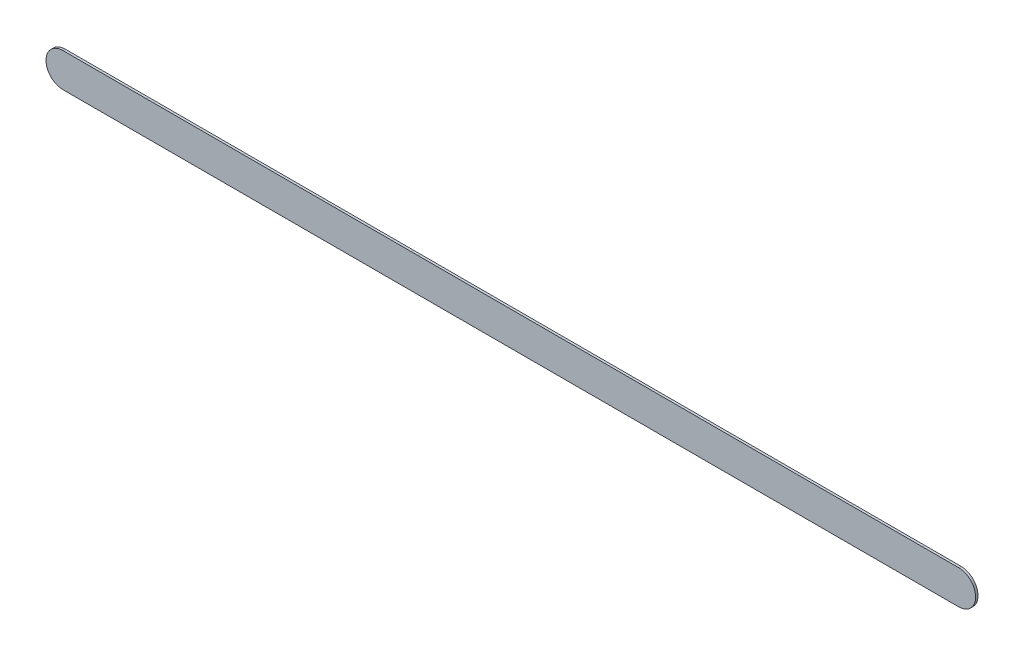
ISO-10303-21;
HEADER;
FILE_DESCRIPTION(('STEP AP214'),'2;1');
FILE_NAME('part.step','',(''),(''),'','','');
FILE_SCHEMA(('AUTOMOTIVE_DESIGN { 1 0 10303 214 1 1 1 1 }'));
ENDSEC;
DATA;
#1=APPLICATION_CONTEXT('core data for automotive mechanical design processes');
#2=APPLICATION_PROTOCOL_DEFINITION('international standard','automotive_design',2000,#1);
#3=PRODUCT_CONTEXT('',#1,'mechanical');
#4=PRODUCT('Part','Part','',(#3));
#5=PRODUCT_RELATED_PRODUCT_CATEGORY('part','',(#4));
#6=PRODUCT_DEFINITION_FORMATION('','',#4);
#7=PRODUCT_DEFINITION_CONTEXT('part definition',#1,'design');
#8=PRODUCT_DEFINITION('design','',#6,#7);
#9=PRODUCT_DEFINITION_SHAPE('','',#8);
#10=(LENGTH_UNIT() NAMED_UNIT(*) SI_UNIT(.MILLI.,.METRE.));
#11=(NAMED_UNIT(*) PLANE_ANGLE_UNIT() SI_UNIT($,.RADIAN.));
#12=(NAMED_UNIT(*) SI_UNIT($,.STERADIAN.) SOLID_ANGLE_UNIT());
#13=UNCERTAINTY_MEASURE_WITH_UNIT(LENGTH_MEASURE(1.E-05),#10,'distance_accuracy_value','');
#14=(GEOMETRIC_REPRESENTATION_CONTEXT(3) GLOBAL_UNCERTAINTY_ASSIGNED_CONTEXT((#13)) GLOBAL_UNIT_ASSIGNED_CONTEXT((#10,
#11,#12)) REPRESENTATION_CONTEXT('',''));
#15=CARTESIAN_POINT('',(0.,0.,0.));
#16=DIRECTION('',(0.,0.,1.));
#17=DIRECTION('',(1.,0.,0.));
#18=AXIS2_PLACEMENT_3D('',#15,#16,#17);
#19=CARTESIAN_POINT('',(171.196,-89.666,0.));
#20=DIRECTION('',(0.,0.,1.));
#21=DIRECTION('',(1.,0.,0.));
#22=AXIS2_PLACEMENT_3D('',#19,#20,#21);
#23=PLANE('',#22);
#24=DIRECTION('',(-1.,0.,0.));
#25=VECTOR('',#24,1.);
#26=CARTESIAN_POINT('',(171.196,-89.666,0.));
#27=LINE('',#26,#25);
#28=CARTESIAN_POINT('',(171.196,-89.666,0.));
#29=VERTEX_POINT('',#28);
#30=CARTESIAN_POINT('',(157.988,-89.666,0.));
#31=VERTEX_POINT('',#30);
#32=EDGE_CURVE('E81',#29,#31,#27,.T.);
#33=ORIENTED_EDGE('',*,*,#32,.T.);
#34=CARTESIAN_POINT('',(157.988,-89.916,0.));
#35=DIRECTION('',(0.,0.,1.));
#36=DIRECTION('',(0.,1.,0.));
#37=AXIS2_PLACEMENT_3D('',#34,#35,#36);
#38=CIRCLE('',#37,0.25);
#39=CARTESIAN_POINT('',(157.988,-90.166,0.));
#40=VERTEX_POINT('',#39);
#41=EDGE_CURVE('E79',#31,#40,#38,.T.);
#42=ORIENTED_EDGE('',*,*,#41,.T.);
#43=DIRECTION('',(1.,0.,0.));
#44=VECTOR('',#43,1.);
#45=CARTESIAN_POINT('',(157.988,-90.166,0.));
#46=LINE('',#45,#44);
#47=CARTESIAN_POINT('',(171.196,-90.166,0.));
#48=VERTEX_POINT('',#47);
#49=EDGE_CURVE('E20',#40,#48,#46,.T.);
#50=ORIENTED_EDGE('',*,*,#49,.T.);
#51=CARTESIAN_POINT('',(171.196,-89.916,0.));
#52=DIRECTION('',(0.,0.,1.));
#53=DIRECTION('',(0.,-1.,0.));
#54=AXIS2_PLACEMENT_3D('',#51,#52,#53);
#55=CIRCLE('',#54,0.25);
#56=EDGE_CURVE('E11',#48,#29,#55,.T.);
#57=ORIENTED_EDGE('',*,*,#56,.T.);
#58=EDGE_LOOP('',(#33,#42,#50,#57));
#59=FACE_BOUND('',#58,.T.);
#60=ADVANCED_FACE('F17',(#59),#23,.T.);
#61=CARTESIAN_POINT('',(171.196,-89.666,-0.035));
#62=DIRECTION('',(0.,0.,1.));
#63=DIRECTION('',(1.,0.,0.));
#64=AXIS2_PLACEMENT_3D('',#61,#62,#63);
#65=PLANE('',#64);
#66=CARTESIAN_POINT('',(171.196,-89.916,-0.035));
#67=DIRECTION('',(0.,0.,1.));
#68=DIRECTION('',(0.,-1.,0.));
#69=AXIS2_PLACEMENT_3D('',#66,#67,#68);
#70=CIRCLE('',#69,0.25);
#71=CARTESIAN_POINT('',(171.196,-90.166,-0.035));
#72=VERTEX_POINT('',#71);
#73=CARTESIAN_POINT('',(171.196,-89.666,-0.035));
#74=VERTEX_POINT('',#73);
#75=EDGE_CURVE('E27',#72,#74,#70,.T.);
#76=ORIENTED_EDGE('',*,*,#75,.F.);
#77=DIRECTION('',(1.,0.,0.));
#78=VECTOR('',#77,1.);
#79=CARTESIAN_POINT('',(157.988,-90.166,-0.035));
#80=LINE('',#79,#78);
#81=CARTESIAN_POINT('',(157.988,-90.166,-0.035));
#82=VERTEX_POINT('',#81);
#83=EDGE_CURVE('E63',#82,#72,#80,.T.);
#84=ORIENTED_EDGE('',*,*,#83,.F.);
#85=CARTESIAN_POINT('',(157.988,-89.916,-0.035));
#86=DIRECTION('',(0.,0.,1.));
#87=DIRECTION('',(0.,1.,0.));
#88=AXIS2_PLACEMENT_3D('',#85,#86,#87);
#89=CIRCLE('',#88,0.25);
#90=CARTESIAN_POINT('',(157.988,-89.666,-0.035));
#91=VERTEX_POINT('',#90);
#92=EDGE_CURVE('E87',#91,#82,#89,.T.);
#93=ORIENTED_EDGE('',*,*,#92,.F.);
#94=DIRECTION('',(-1.,0.,0.));
#95=VECTOR('',#94,1.);
#96=CARTESIAN_POINT('',(171.196,-89.666,-0.035));
#97=LINE('',#96,#95);
#98=EDGE_CURVE('E105',#74,#91,#97,.T.);
#99=ORIENTED_EDGE('',*,*,#98,.F.);
#100=EDGE_LOOP('',(#76,#84,#93,#99));
#101=FACE_BOUND('',#100,.T.);
#102=ADVANCED_FACE('F121',(#101),#65,.F.);
#103=CARTESIAN_POINT('',(171.196,-89.916,-0.035));
#104=DIRECTION('',(0.,0.,-1.));
#105=DIRECTION('',(0.,-1.,0.));
#106=AXIS2_PLACEMENT_3D('',#103,#104,#105);
#107=CYLINDRICAL_SURFACE('',#106,0.25);
#108=ORIENTED_EDGE('',*,*,#75,.T.);
#109=DIRECTION('',(0.,0.,1.));
#110=VECTOR('',#109,1.);
#111=CARTESIAN_POINT('',(171.196,-89.666,-0.035));
#112=LINE('',#111,#110);
#113=EDGE_CURVE('E94',#74,#29,#112,.T.);
#114=ORIENTED_EDGE('',*,*,#113,.T.);
#115=ORIENTED_EDGE('',*,*,#56,.F.);
#116=DIRECTION('',(0.,0.,1.));
#117=VECTOR('',#116,1.);
#118=CARTESIAN_POINT('',(171.196,-90.166,-0.035));
#119=LINE('',#118,#117);
#120=EDGE_CURVE('E75',#72,#48,#119,.T.);
#121=ORIENTED_EDGE('',*,*,#120,.F.);
#122=EDGE_LOOP('',(#108,#114,#115,#121));
#123=FACE_BOUND('',#122,.T.);
#124=ADVANCED_FACE('F117',(#123),#107,.T.);
#125=CARTESIAN_POINT('',(157.988,-90.166,-0.035));
#126=DIRECTION('',(0.,1.,0.));
#127=DIRECTION('',(1.,0.,0.));
#128=AXIS2_PLACEMENT_3D('',#125,#126,#127);
#129=PLANE('',#128);
#130=ORIENTED_EDGE('',*,*,#83,.T.);
#131=ORIENTED_EDGE('',*,*,#120,.T.);
#132=ORIENTED_EDGE('',*,*,#49,.F.);
#133=DIRECTION('',(0.,0.,1.));
#134=VECTOR('',#133,1.);
#135=CARTESIAN_POINT('',(157.988,-90.166,-0.035));
#136=LINE('',#135,#134);
#137=EDGE_CURVE('E73',#82,#40,#136,.T.);
#138=ORIENTED_EDGE('',*,*,#137,.F.);
#139=EDGE_LOOP('',(#130,#131,#132,#138));
#140=FACE_BOUND('',#139,.T.);
#141=ADVANCED_FACE('F71',(#140),#129,.F.);
#142=CARTESIAN_POINT('',(157.988,-89.916,-0.035));
#143=DIRECTION('',(0.,0.,-1.));
#144=DIRECTION('',(0.,1.,0.));
#145=AXIS2_PLACEMENT_3D('',#142,#143,#144);
#146=CYLINDRICAL_SURFACE('',#145,0.25);
#147=ORIENTED_EDGE('',*,*,#92,.T.);
#148=ORIENTED_EDGE('',*,*,#137,.T.);
#149=ORIENTED_EDGE('',*,*,#41,.F.);
#150=DIRECTION('',(0.,0.,1.));
#151=VECTOR('',#150,1.);
#152=CARTESIAN_POINT('',(157.988,-89.666,-0.035));
#153=LINE('',#152,#151);
#154=EDGE_CURVE('E103',#91,#31,#153,.T.);
#155=ORIENTED_EDGE('',*,*,#154,.F.);
#156=EDGE_LOOP('',(#147,#148,#149,#155));
#157=FACE_BOUND('',#156,.T.);
#158=ADVANCED_FACE('F86',(#157),#146,.T.);
#159=CARTESIAN_POINT('',(171.196,-89.666,-0.035));
#160=DIRECTION('',(0.,-1.,0.));
#161=DIRECTION('',(0.,0.,-1.));
#162=AXIS2_PLACEMENT_3D('',#159,#160,#161);
#163=PLANE('',#162);
#164=ORIENTED_EDGE('',*,*,#98,.T.);
#165=ORIENTED_EDGE('',*,*,#154,.T.);
#166=ORIENTED_EDGE('',*,*,#32,.F.);
#167=ORIENTED_EDGE('',*,*,#113,.F.);
#168=EDGE_LOOP('',(#164,#165,#166,#167));
#169=FACE_BOUND('',#168,.T.);
#170=ADVANCED_FACE('F120',(#169),#163,.F.);
#171=CLOSED_SHELL('',(#60,#102,#124,#141,#158,#170));
#172=MANIFOLD_SOLID_BREP('B1',#171);
#173=ADVANCED_BREP_SHAPE_REPRESENTATION('',(#18,#172),#14);
#174=SHAPE_DEFINITION_REPRESENTATION(#9,#173);
ENDSEC;
END-ISO-10303-21;
